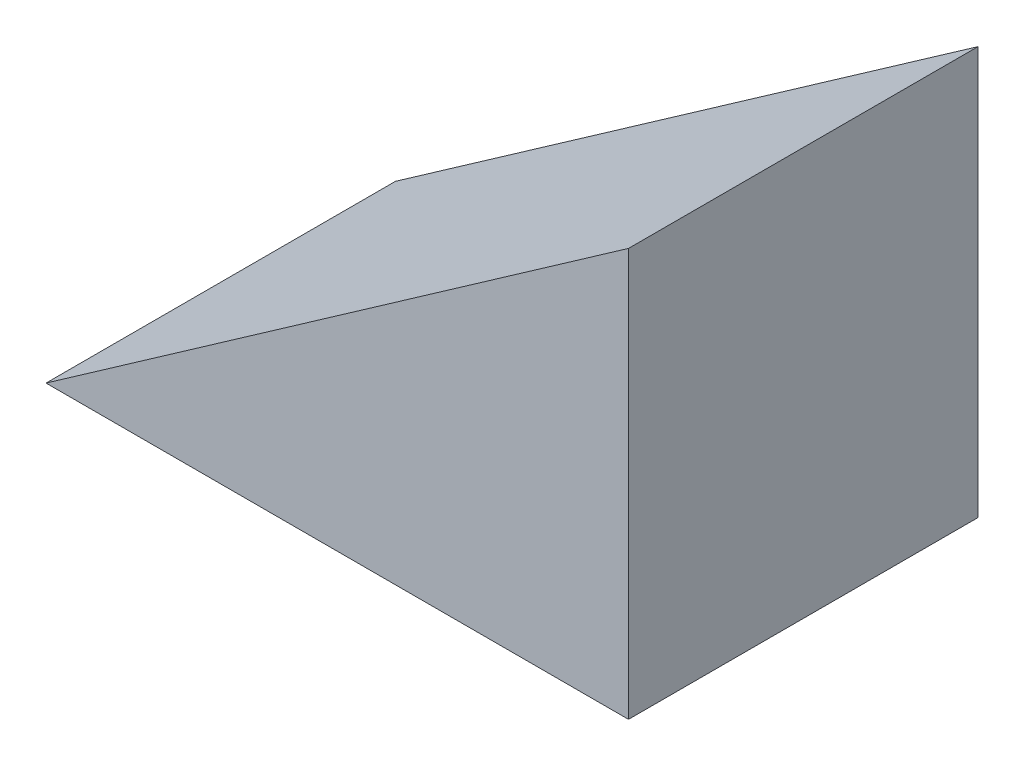
ISO-10303-21;
HEADER;
FILE_DESCRIPTION(('STEP AP214'),'2;1');
FILE_NAME('part.step','',(''),(''),'','','');
FILE_SCHEMA(('AUTOMOTIVE_DESIGN { 1 0 10303 214 1 1 1 1 }'));
ENDSEC;
DATA;
#1=APPLICATION_CONTEXT('core data for automotive mechanical design processes');
#2=APPLICATION_PROTOCOL_DEFINITION('international standard','automotive_design',2000,#1);
#3=PRODUCT_CONTEXT('',#1,'mechanical');
#4=PRODUCT('Part','Part','',(#3));
#5=PRODUCT_RELATED_PRODUCT_CATEGORY('part','',(#4));
#6=PRODUCT_DEFINITION_FORMATION('','',#4);
#7=PRODUCT_DEFINITION_CONTEXT('part definition',#1,'design');
#8=PRODUCT_DEFINITION('design','',#6,#7);
#9=PRODUCT_DEFINITION_SHAPE('','',#8);
#10=(LENGTH_UNIT() NAMED_UNIT(*) SI_UNIT(.MILLI.,.METRE.));
#11=(NAMED_UNIT(*) PLANE_ANGLE_UNIT() SI_UNIT($,.RADIAN.));
#12=(NAMED_UNIT(*) SI_UNIT($,.STERADIAN.) SOLID_ANGLE_UNIT());
#13=UNCERTAINTY_MEASURE_WITH_UNIT(LENGTH_MEASURE(1.E-05),#10,'distance_accuracy_value','');
#14=(GEOMETRIC_REPRESENTATION_CONTEXT(3) GLOBAL_UNCERTAINTY_ASSIGNED_CONTEXT((#13)) GLOBAL_UNIT_ASSIGNED_CONTEXT((#10,
#11,#12)) REPRESENTATION_CONTEXT('',''));
#15=CARTESIAN_POINT('',(0.,0.,0.));
#16=DIRECTION('',(0.,0.,1.));
#17=DIRECTION('',(1.,0.,0.));
#18=AXIS2_PLACEMENT_3D('',#15,#16,#17);
#19=CARTESIAN_POINT('',(0.,35.0103769104851,30.));
#20=DIRECTION('',(-1.,0.,0.));
#21=DIRECTION('',(0.,0.,1.));
#22=AXIS2_PLACEMENT_3D('',#19,#20,#21);
#23=PLANE('',#22);
#24=DIRECTION('',(0.,1.,0.));
#25=VECTOR('',#24,1.);
#26=CARTESIAN_POINT('',(0.,35.0103769104851,0.));
#27=LINE('',#26,#25);
#28=CARTESIAN_POINT('',(0.,0.,0.));
#29=VERTEX_POINT('',#28);
#30=CARTESIAN_POINT('',(0.,35.0103769104851,0.));
#31=VERTEX_POINT('',#30);
#32=EDGE_CURVE('E80',#29,#31,#27,.T.);
#33=ORIENTED_EDGE('',*,*,#32,.T.);
#34=DIRECTION('',(0.,0.,-1.));
#35=VECTOR('',#34,1.);
#36=CARTESIAN_POINT('',(0.,35.0103769104851,30.));
#37=LINE('',#36,#35);
#38=CARTESIAN_POINT('',(0.,35.0103769104851,30.));
#39=VERTEX_POINT('',#38);
#40=EDGE_CURVE('E11',#39,#31,#37,.T.);
#41=ORIENTED_EDGE('',*,*,#40,.F.);
#42=DIRECTION('',(0.,1.,0.));
#43=VECTOR('',#42,1.);
#44=CARTESIAN_POINT('',(0.,35.0103769104851,30.));
#45=LINE('',#44,#43);
#46=CARTESIAN_POINT('',(0.,0.,30.));
#47=VERTEX_POINT('',#46);
#48=EDGE_CURVE('E73',#47,#39,#45,.T.);
#49=ORIENTED_EDGE('',*,*,#48,.F.);
#50=DIRECTION('',(0.,0.,-1.));
#51=VECTOR('',#50,1.);
#52=CARTESIAN_POINT('',(0.,0.,30.));
#53=LINE('',#52,#51);
#54=EDGE_CURVE('E81',#47,#29,#53,.T.);
#55=ORIENTED_EDGE('',*,*,#54,.T.);
#56=EDGE_LOOP('',(#33,#41,#49,#55));
#57=FACE_BOUND('',#56,.T.);
#58=ADVANCED_FACE('F33',(#57),#23,.F.);
#59=CARTESIAN_POINT('',(-50.,0.,30.));
#60=DIRECTION('',(0.573576436351042,-0.819152044288995,0.));
#61=DIRECTION('',(0.819152044288995,0.573576436351042,0.));
#62=AXIS2_PLACEMENT_3D('',#59,#60,#61);
#63=PLANE('',#62);
#64=DIRECTION('',(-0.819152044288995,-0.573576436351042,0.));
#65=VECTOR('',#64,1.);
#66=CARTESIAN_POINT('',(-50.,0.,0.));
#67=LINE('',#66,#65);
#68=CARTESIAN_POINT('',(-50.,0.,0.));
#69=VERTEX_POINT('',#68);
#70=EDGE_CURVE('E61',#31,#69,#67,.T.);
#71=ORIENTED_EDGE('',*,*,#70,.T.);
#72=DIRECTION('',(0.,0.,-1.));
#73=VECTOR('',#72,1.);
#74=CARTESIAN_POINT('',(-50.,0.,30.));
#75=LINE('',#74,#73);
#76=CARTESIAN_POINT('',(-50.,0.,30.));
#77=VERTEX_POINT('',#76);
#78=EDGE_CURVE('E41',#77,#69,#75,.T.);
#79=ORIENTED_EDGE('',*,*,#78,.F.);
#80=DIRECTION('',(-0.819152044288995,-0.573576436351042,0.));
#81=VECTOR('',#80,1.);
#82=CARTESIAN_POINT('',(-50.,0.,30.));
#83=LINE('',#82,#81);
#84=EDGE_CURVE('E69',#39,#77,#83,.T.);
#85=ORIENTED_EDGE('',*,*,#84,.F.);
#86=ORIENTED_EDGE('',*,*,#40,.T.);
#87=EDGE_LOOP('',(#71,#79,#85,#86));
#88=FACE_BOUND('',#87,.T.);
#89=ADVANCED_FACE('F70',(#88),#63,.F.);
#90=CARTESIAN_POINT('',(0.,0.,30.));
#91=DIRECTION('',(0.,1.,0.));
#92=DIRECTION('',(0.,0.,1.));
#93=AXIS2_PLACEMENT_3D('',#90,#91,#92);
#94=PLANE('',#93);
#95=DIRECTION('',(1.,0.,0.));
#96=VECTOR('',#95,1.);
#97=CARTESIAN_POINT('',(0.,0.,0.));
#98=LINE('',#97,#96);
#99=EDGE_CURVE('E66',#69,#29,#98,.T.);
#100=ORIENTED_EDGE('',*,*,#99,.T.);
#101=ORIENTED_EDGE('',*,*,#54,.F.);
#102=DIRECTION('',(1.,0.,0.));
#103=VECTOR('',#102,1.);
#104=CARTESIAN_POINT('',(0.,0.,30.));
#105=LINE('',#104,#103);
#106=EDGE_CURVE('E49',#77,#47,#105,.T.);
#107=ORIENTED_EDGE('',*,*,#106,.F.);
#108=ORIENTED_EDGE('',*,*,#78,.T.);
#109=EDGE_LOOP('',(#100,#101,#107,#108));
#110=FACE_BOUND('',#109,.T.);
#111=ADVANCED_FACE('F88',(#110),#94,.F.);
#112=CARTESIAN_POINT('',(0.,0.,30.));
#113=DIRECTION('',(0.,0.,-1.));
#114=DIRECTION('',(-1.,0.,0.));
#115=AXIS2_PLACEMENT_3D('',#112,#113,#114);
#116=PLANE('',#115);
#117=ORIENTED_EDGE('',*,*,#48,.T.);
#118=ORIENTED_EDGE('',*,*,#84,.T.);
#119=ORIENTED_EDGE('',*,*,#106,.T.);
#120=EDGE_LOOP('',(#117,#118,#119));
#121=FACE_BOUND('',#120,.T.);
#122=ADVANCED_FACE('F76',(#121),#116,.F.);
#123=CARTESIAN_POINT('',(0.,0.,0.));
#124=DIRECTION('',(0.,0.,-1.));
#125=DIRECTION('',(-1.,0.,0.));
#126=AXIS2_PLACEMENT_3D('',#123,#124,#125);
#127=PLANE('',#126);
#128=ORIENTED_EDGE('',*,*,#32,.F.);
#129=ORIENTED_EDGE('',*,*,#99,.F.);
#130=ORIENTED_EDGE('',*,*,#70,.F.);
#131=EDGE_LOOP('',(#128,#129,#130));
#132=FACE_BOUND('',#131,.T.);
#133=ADVANCED_FACE('F89',(#132),#127,.T.);
#134=CLOSED_SHELL('',(#58,#89,#111,#122,#133));
#135=MANIFOLD_SOLID_BREP('B2',#134);
#136=ADVANCED_BREP_SHAPE_REPRESENTATION('',(#18,#135),#14);
#137=SHAPE_DEFINITION_REPRESENTATION(#9,#136);
ENDSEC;
END-ISO-10303-21;
